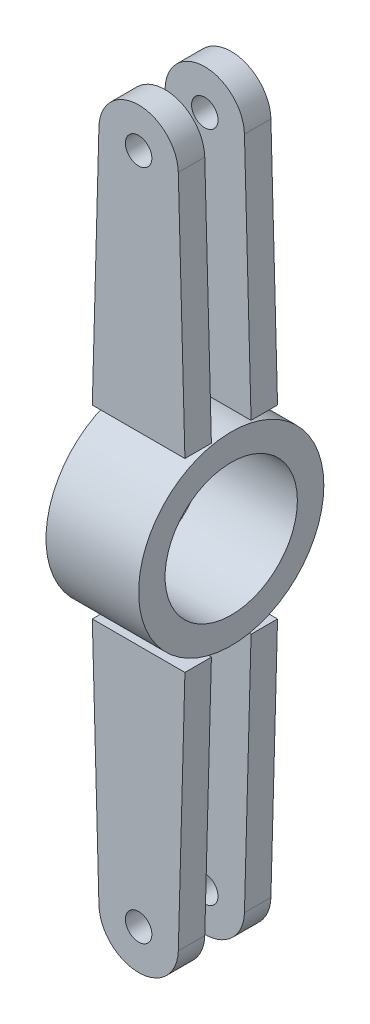
ISO-10303-21;
HEADER;
FILE_DESCRIPTION(('STEP AP214'),'2;1');
FILE_NAME('part.step','',(''),(''),'','','');
FILE_SCHEMA(('AUTOMOTIVE_DESIGN { 1 0 10303 214 1 1 1 1 }'));
ENDSEC;
DATA;
#1=APPLICATION_CONTEXT('core data for automotive mechanical design processes');
#2=APPLICATION_PROTOCOL_DEFINITION('international standard','automotive_design',2000,#1);
#3=PRODUCT_CONTEXT('',#1,'mechanical');
#4=PRODUCT('Part','Part','',(#3));
#5=PRODUCT_RELATED_PRODUCT_CATEGORY('part','',(#4));
#6=PRODUCT_DEFINITION_FORMATION('','',#4);
#7=PRODUCT_DEFINITION_CONTEXT('part definition',#1,'design');
#8=PRODUCT_DEFINITION('design','',#6,#7);
#9=PRODUCT_DEFINITION_SHAPE('','',#8);
#10=(LENGTH_UNIT() NAMED_UNIT(*) SI_UNIT(.MILLI.,.METRE.));
#11=(NAMED_UNIT(*) PLANE_ANGLE_UNIT() SI_UNIT($,.RADIAN.));
#12=(NAMED_UNIT(*) SI_UNIT($,.STERADIAN.) SOLID_ANGLE_UNIT());
#13=UNCERTAINTY_MEASURE_WITH_UNIT(LENGTH_MEASURE(1.E-05),#10,'distance_accuracy_value','');
#14=(GEOMETRIC_REPRESENTATION_CONTEXT(3) GLOBAL_UNCERTAINTY_ASSIGNED_CONTEXT((#13)) GLOBAL_UNIT_ASSIGNED_CONTEXT((#10,
#11,#12)) REPRESENTATION_CONTEXT('',''));
#15=CARTESIAN_POINT('',(0.,0.,0.));
#16=DIRECTION('',(0.,0.,1.));
#17=DIRECTION('',(1.,0.,0.));
#18=AXIS2_PLACEMENT_3D('',#15,#16,#17);
#19=CARTESIAN_POINT('',(0.,127.,17.5));
#20=DIRECTION('',(0.,0.,-1.));
#21=DIRECTION('',(-1.,0.,0.));
#22=AXIS2_PLACEMENT_3D('',#19,#20,#21);
#23=PLANE('',#22);
#24=CARTESIAN_POINT('',(0.,127.,17.5));
#25=DIRECTION('',(0.,0.,1.));
#26=DIRECTION('',(-1.,0.,0.));
#27=AXIS2_PLACEMENT_3D('',#24,#25,#26);
#28=CIRCLE('',#27,15.);
#29=CARTESIAN_POINT('',(14.9944892741488,127.406560459757,17.5));
#30=VERTEX_POINT('',#29);
#31=CARTESIAN_POINT('',(-14.9944892741488,127.406560459757,17.5));
#32=VERTEX_POINT('',#31);
#33=EDGE_CURVE('E100',#30,#32,#28,.T.);
#34=ORIENTED_EDGE('',*,*,#33,.T.);
#35=DIRECTION('',(-0.0271040306504374,-0.999632618276585,0.));
#36=VECTOR('',#35,1.);
#37=CARTESIAN_POINT('',(-17.5,35.,17.5));
#38=LINE('',#37,#36);
#39=CARTESIAN_POINT('',(-17.5,35.,17.5));
#40=VERTEX_POINT('',#39);
#41=EDGE_CURVE('E95',#32,#40,#38,.T.);
#42=ORIENTED_EDGE('',*,*,#41,.T.);
#43=DIRECTION('',(1.,0.,0.));
#44=VECTOR('',#43,1.);
#45=CARTESIAN_POINT('',(-17.5,35.,17.5));
#46=LINE('',#45,#44);
#47=CARTESIAN_POINT('',(17.5,35.,17.5));
#48=VERTEX_POINT('',#47);
#49=EDGE_CURVE('E98',#40,#48,#46,.T.);
#50=ORIENTED_EDGE('',*,*,#49,.T.);
#51=DIRECTION('',(-0.0271040306504372,0.999632618276585,0.));
#52=VECTOR('',#51,1.);
#53=CARTESIAN_POINT('',(17.5,35.,17.5));
#54=LINE('',#53,#52);
#55=EDGE_CURVE('E65',#48,#30,#54,.T.);
#56=ORIENTED_EDGE('',*,*,#55,.T.);
#57=EDGE_LOOP('',(#34,#42,#50,#56));
#58=FACE_BOUND('',#57,.T.);
#59=CARTESIAN_POINT('',(0.,127.,17.5));
#60=DIRECTION('',(0.,0.,1.));
#61=DIRECTION('',(-1.,0.,0.));
#62=AXIS2_PLACEMENT_3D('',#59,#60,#61);
#63=CIRCLE('',#62,5.);
#64=CARTESIAN_POINT('',(-4.99999999999999,127.,17.5));
#65=VERTEX_POINT('',#64);
#66=EDGE_CURVE('E115',#65,#65,#63,.T.);
#67=ORIENTED_EDGE('',*,*,#66,.F.);
#68=EDGE_LOOP('',(#67));
#69=FACE_BOUND('',#68,.T.);
#70=ADVANCED_FACE('F48',(#58,#69),#23,.F.);
#71=CARTESIAN_POINT('',(0.,127.,7.5));
#72=DIRECTION('',(0.,0.,-1.));
#73=DIRECTION('',(-1.,0.,0.));
#74=AXIS2_PLACEMENT_3D('',#71,#72,#73);
#75=PLANE('',#74);
#76=CARTESIAN_POINT('',(0.,127.,7.5));
#77=DIRECTION('',(0.,0.,1.));
#78=DIRECTION('',(-1.,0.,0.));
#79=AXIS2_PLACEMENT_3D('',#76,#77,#78);
#80=CIRCLE('',#79,15.);
#81=CARTESIAN_POINT('',(14.9944892741488,127.406560459757,7.5));
#82=VERTEX_POINT('',#81);
#83=CARTESIAN_POINT('',(-14.9944892741488,127.406560459757,7.5));
#84=VERTEX_POINT('',#83);
#85=EDGE_CURVE('E112',#82,#84,#80,.T.);
#86=ORIENTED_EDGE('',*,*,#85,.F.);
#87=DIRECTION('',(-0.0271040306504372,0.999632618276585,0.));
#88=VECTOR('',#87,1.);
#89=CARTESIAN_POINT('',(17.5,35.,7.5));
#90=LINE('',#89,#88);
#91=CARTESIAN_POINT('',(17.5,35.,7.5));
#92=VERTEX_POINT('',#91);
#93=EDGE_CURVE('E88',#92,#82,#90,.T.);
#94=ORIENTED_EDGE('',*,*,#93,.F.);
#95=DIRECTION('',(1.,0.,0.));
#96=VECTOR('',#95,1.);
#97=CARTESIAN_POINT('',(-17.5,35.,7.5));
#98=LINE('',#97,#96);
#99=CARTESIAN_POINT('',(-17.5,35.,7.5));
#100=VERTEX_POINT('',#99);
#101=EDGE_CURVE('E82',#100,#92,#98,.T.);
#102=ORIENTED_EDGE('',*,*,#101,.F.);
#103=DIRECTION('',(-0.0271040306504374,-0.999632618276585,0.));
#104=VECTOR('',#103,1.);
#105=CARTESIAN_POINT('',(-17.5,35.,7.5));
#106=LINE('',#105,#104);
#107=EDGE_CURVE('E104',#84,#100,#106,.T.);
#108=ORIENTED_EDGE('',*,*,#107,.F.);
#109=EDGE_LOOP('',(#86,#94,#102,#108));
#110=FACE_BOUND('',#109,.T.);
#111=CARTESIAN_POINT('',(0.,127.,7.5));
#112=DIRECTION('',(0.,0.,1.));
#113=DIRECTION('',(-1.,0.,0.));
#114=AXIS2_PLACEMENT_3D('',#111,#112,#113);
#115=CIRCLE('',#114,5.);
#116=CARTESIAN_POINT('',(-4.99999999999999,127.,7.5));
#117=VERTEX_POINT('',#116);
#118=EDGE_CURVE('E127',#117,#117,#115,.T.);
#119=ORIENTED_EDGE('',*,*,#118,.T.);
#120=EDGE_LOOP('',(#119));
#121=FACE_BOUND('',#120,.T.);
#122=ADVANCED_FACE('F123',(#110,#121),#75,.T.);
#123=CARTESIAN_POINT('',(0.,127.,17.5));
#124=DIRECTION('',(0.,0.,-1.));
#125=DIRECTION('',(-1.,0.,0.));
#126=AXIS2_PLACEMENT_3D('',#123,#124,#125);
#127=CYLINDRICAL_SURFACE('',#126,15.);
#128=ORIENTED_EDGE('',*,*,#85,.T.);
#129=DIRECTION('',(0.,0.,-1.));
#130=VECTOR('',#129,1.);
#131=CARTESIAN_POINT('',(-14.9944892741488,127.406560459757,17.5));
#132=LINE('',#131,#130);
#133=EDGE_CURVE('E12',#32,#84,#132,.T.);
#134=ORIENTED_EDGE('',*,*,#133,.F.);
#135=ORIENTED_EDGE('',*,*,#33,.F.);
#136=DIRECTION('',(0.,0.,-1.));
#137=VECTOR('',#136,1.);
#138=CARTESIAN_POINT('',(14.9944892741488,127.406560459757,17.5));
#139=LINE('',#138,#137);
#140=EDGE_CURVE('E108',#30,#82,#139,.T.);
#141=ORIENTED_EDGE('',*,*,#140,.T.);
#142=EDGE_LOOP('',(#128,#134,#135,#141));
#143=FACE_BOUND('',#142,.T.);
#144=ADVANCED_FACE('F50',(#143),#127,.T.);
#145=CARTESIAN_POINT('',(-17.5,35.,17.5));
#146=DIRECTION('',(0.999632618276585,-0.0271040306504374,0.));
#147=DIRECTION('',(0.0271040306504374,0.999632618276585,0.));
#148=AXIS2_PLACEMENT_3D('',#145,#146,#147);
#149=PLANE('',#148);
#150=ORIENTED_EDGE('',*,*,#107,.T.);
#151=DIRECTION('',(0.,0.,-1.));
#152=VECTOR('',#151,1.);
#153=CARTESIAN_POINT('',(-17.5,35.,17.5));
#154=LINE('',#153,#152);
#155=EDGE_CURVE('E57',#40,#100,#154,.T.);
#156=ORIENTED_EDGE('',*,*,#155,.F.);
#157=ORIENTED_EDGE('',*,*,#41,.F.);
#158=ORIENTED_EDGE('',*,*,#133,.T.);
#159=EDGE_LOOP('',(#150,#156,#157,#158));
#160=FACE_BOUND('',#159,.T.);
#161=ADVANCED_FACE('F103',(#160),#149,.F.);
#162=CARTESIAN_POINT('',(-17.5,35.,17.5));
#163=DIRECTION('',(0.,1.,0.));
#164=DIRECTION('',(0.,0.,1.));
#165=AXIS2_PLACEMENT_3D('',#162,#163,#164);
#166=PLANE('',#165);
#167=ORIENTED_EDGE('',*,*,#101,.T.);
#168=DIRECTION('',(0.,0.,-1.));
#169=VECTOR('',#168,1.);
#170=CARTESIAN_POINT('',(17.5,35.,17.5));
#171=LINE('',#170,#169);
#172=EDGE_CURVE('E105',#48,#92,#171,.T.);
#173=ORIENTED_EDGE('',*,*,#172,.F.);
#174=ORIENTED_EDGE('',*,*,#49,.F.);
#175=ORIENTED_EDGE('',*,*,#155,.T.);
#176=EDGE_LOOP('',(#167,#173,#174,#175));
#177=FACE_BOUND('',#176,.T.);
#178=ADVANCED_FACE('F106',(#177),#166,.F.);
#179=CARTESIAN_POINT('',(17.5,35.,17.5));
#180=DIRECTION('',(-0.999632618276585,-0.0271040306504372,0.));
#181=DIRECTION('',(0.0271040306504372,-0.999632618276585,0.));
#182=AXIS2_PLACEMENT_3D('',#179,#180,#181);
#183=PLANE('',#182);
#184=ORIENTED_EDGE('',*,*,#93,.T.);
#185=ORIENTED_EDGE('',*,*,#140,.F.);
#186=ORIENTED_EDGE('',*,*,#55,.F.);
#187=ORIENTED_EDGE('',*,*,#172,.T.);
#188=EDGE_LOOP('',(#184,#185,#186,#187));
#189=FACE_BOUND('',#188,.T.);
#190=ADVANCED_FACE('F120',(#189),#183,.F.);
#191=CARTESIAN_POINT('',(0.,127.,17.5));
#192=DIRECTION('',(0.,0.,-1.));
#193=DIRECTION('',(-1.,0.,0.));
#194=AXIS2_PLACEMENT_3D('',#191,#192,#193);
#195=CYLINDRICAL_SURFACE('',#194,5.);
#196=ORIENTED_EDGE('',*,*,#66,.T.);
#197=EDGE_LOOP('',(#196));
#198=FACE_BOUND('',#197,.T.);
#199=ORIENTED_EDGE('',*,*,#118,.F.);
#200=EDGE_LOOP('',(#199));
#201=FACE_BOUND('',#200,.T.);
#202=ADVANCED_FACE('F133',(#198,#201),#195,.F.);
#203=CLOSED_SHELL('',(#70,#122,#144,#161,#178,#190,#202));
#204=MANIFOLD_SOLID_BREP('B2',#203);
#205=CARTESIAN_POINT('',(0.,-127.,17.5));
#206=DIRECTION('',(0.,0.,1.));
#207=DIRECTION('',(1.,0.,0.));
#208=AXIS2_PLACEMENT_3D('',#205,#206,#207);
#209=PLANE('',#208);
#210=CARTESIAN_POINT('',(0.,-127.,17.5));
#211=DIRECTION('',(0.,0.,1.));
#212=DIRECTION('',(1.,0.,0.));
#213=AXIS2_PLACEMENT_3D('',#210,#211,#212);
#214=CIRCLE('',#213,15.);
#215=CARTESIAN_POINT('',(-14.9944892741488,-127.406560459757,17.5));
#216=VERTEX_POINT('',#215);
#217=CARTESIAN_POINT('',(14.9944892741488,-127.406560459757,17.5));
#218=VERTEX_POINT('',#217);
#219=EDGE_CURVE('E255',#216,#218,#214,.T.);
#220=ORIENTED_EDGE('',*,*,#219,.T.);
#221=DIRECTION('',(0.0271040306504372,0.999632618276585,0.));
#222=VECTOR('',#221,1.);
#223=CARTESIAN_POINT('',(17.5,-35.,17.5));
#224=LINE('',#223,#222);
#225=CARTESIAN_POINT('',(17.5,-35.,17.5));
#226=VERTEX_POINT('',#225);
#227=EDGE_CURVE('E250',#218,#226,#224,.T.);
#228=ORIENTED_EDGE('',*,*,#227,.T.);
#229=DIRECTION('',(-1.,0.,0.));
#230=VECTOR('',#229,1.);
#231=CARTESIAN_POINT('',(-17.5,-35.,17.5));
#232=LINE('',#231,#230);
#233=CARTESIAN_POINT('',(-17.5,-35.,17.5));
#234=VERTEX_POINT('',#233);
#235=EDGE_CURVE('E253',#226,#234,#232,.T.);
#236=ORIENTED_EDGE('',*,*,#235,.T.);
#237=DIRECTION('',(0.0271040306504374,-0.999632618276585,0.));
#238=VECTOR('',#237,1.);
#239=CARTESIAN_POINT('',(-17.5,-35.,17.5));
#240=LINE('',#239,#238);
#241=EDGE_CURVE('E220',#234,#216,#240,.T.);
#242=ORIENTED_EDGE('',*,*,#241,.T.);
#243=EDGE_LOOP('',(#220,#228,#236,#242));
#244=FACE_BOUND('',#243,.T.);
#245=CARTESIAN_POINT('',(0.,-127.,17.5));
#246=DIRECTION('',(0.,0.,1.));
#247=DIRECTION('',(1.,0.,0.));
#248=AXIS2_PLACEMENT_3D('',#245,#246,#247);
#249=CIRCLE('',#248,5.);
#250=CARTESIAN_POINT('',(5.00000000000002,-127.,17.5));
#251=VERTEX_POINT('',#250);
#252=EDGE_CURVE('E270',#251,#251,#249,.T.);
#253=ORIENTED_EDGE('',*,*,#252,.F.);
#254=EDGE_LOOP('',(#253));
#255=FACE_BOUND('',#254,.T.);
#256=ADVANCED_FACE('F203',(#244,#255),#209,.T.);
#257=CARTESIAN_POINT('',(0.,-127.,7.5));
#258=DIRECTION('',(0.,0.,1.));
#259=DIRECTION('',(1.,0.,0.));
#260=AXIS2_PLACEMENT_3D('',#257,#258,#259);
#261=PLANE('',#260);
#262=CARTESIAN_POINT('',(0.,-127.,7.5));
#263=DIRECTION('',(0.,0.,1.));
#264=DIRECTION('',(1.,0.,0.));
#265=AXIS2_PLACEMENT_3D('',#262,#263,#264);
#266=CIRCLE('',#265,15.);
#267=CARTESIAN_POINT('',(-14.9944892741488,-127.406560459757,7.5));
#268=VERTEX_POINT('',#267);
#269=CARTESIAN_POINT('',(14.9944892741488,-127.406560459757,7.5));
#270=VERTEX_POINT('',#269);
#271=EDGE_CURVE('E267',#268,#270,#266,.T.);
#272=ORIENTED_EDGE('',*,*,#271,.F.);
#273=DIRECTION('',(0.0271040306504374,-0.999632618276585,0.));
#274=VECTOR('',#273,1.);
#275=CARTESIAN_POINT('',(-17.5,-35.,7.5));
#276=LINE('',#275,#274);
#277=CARTESIAN_POINT('',(-17.5,-35.,7.5));
#278=VERTEX_POINT('',#277);
#279=EDGE_CURVE('E243',#278,#268,#276,.T.);
#280=ORIENTED_EDGE('',*,*,#279,.F.);
#281=DIRECTION('',(-1.,0.,0.));
#282=VECTOR('',#281,1.);
#283=CARTESIAN_POINT('',(-17.5,-35.,7.5));
#284=LINE('',#283,#282);
#285=CARTESIAN_POINT('',(17.5,-35.,7.5));
#286=VERTEX_POINT('',#285);
#287=EDGE_CURVE('E237',#286,#278,#284,.T.);
#288=ORIENTED_EDGE('',*,*,#287,.F.);
#289=DIRECTION('',(0.0271040306504372,0.999632618276585,0.));
#290=VECTOR('',#289,1.);
#291=CARTESIAN_POINT('',(17.5,-35.,7.5));
#292=LINE('',#291,#290);
#293=EDGE_CURVE('E259',#270,#286,#292,.T.);
#294=ORIENTED_EDGE('',*,*,#293,.F.);
#295=EDGE_LOOP('',(#272,#280,#288,#294));
#296=FACE_BOUND('',#295,.T.);
#297=CARTESIAN_POINT('',(0.,-127.,7.5));
#298=DIRECTION('',(0.,0.,1.));
#299=DIRECTION('',(1.,0.,0.));
#300=AXIS2_PLACEMENT_3D('',#297,#298,#299);
#301=CIRCLE('',#300,5.);
#302=CARTESIAN_POINT('',(5.00000000000002,-127.,7.5));
#303=VERTEX_POINT('',#302);
#304=EDGE_CURVE('E282',#303,#303,#301,.T.);
#305=ORIENTED_EDGE('',*,*,#304,.T.);
#306=EDGE_LOOP('',(#305));
#307=FACE_BOUND('',#306,.T.);
#308=ADVANCED_FACE('F278',(#296,#307),#261,.F.);
#309=CARTESIAN_POINT('',(0.,-127.,17.5));
#310=DIRECTION('',(0.,0.,-1.));
#311=DIRECTION('',(-1.,0.,0.));
#312=AXIS2_PLACEMENT_3D('',#309,#310,#311);
#313=CYLINDRICAL_SURFACE('',#312,15.);
#314=ORIENTED_EDGE('',*,*,#271,.T.);
#315=DIRECTION('',(0.,0.,-1.));
#316=VECTOR('',#315,1.);
#317=CARTESIAN_POINT('',(14.9944892741488,-127.406560459757,17.5));
#318=LINE('',#317,#316);
#319=EDGE_CURVE('E46',#218,#270,#318,.T.);
#320=ORIENTED_EDGE('',*,*,#319,.F.);
#321=ORIENTED_EDGE('',*,*,#219,.F.);
#322=DIRECTION('',(0.,0.,-1.));
#323=VECTOR('',#322,1.);
#324=CARTESIAN_POINT('',(-14.9944892741488,-127.406560459757,17.5));
#325=LINE('',#324,#323);
#326=EDGE_CURVE('E263',#216,#268,#325,.T.);
#327=ORIENTED_EDGE('',*,*,#326,.T.);
#328=EDGE_LOOP('',(#314,#320,#321,#327));
#329=FACE_BOUND('',#328,.T.);
#330=ADVANCED_FACE('F205',(#329),#313,.T.);
#331=CARTESIAN_POINT('',(17.5,-35.,17.5));
#332=DIRECTION('',(-0.999632618276585,0.0271040306504372,0.));
#333=DIRECTION('',(-0.0271040306504372,-0.999632618276585,0.));
#334=AXIS2_PLACEMENT_3D('',#331,#332,#333);
#335=PLANE('',#334);
#336=ORIENTED_EDGE('',*,*,#293,.T.);
#337=DIRECTION('',(0.,0.,-1.));
#338=VECTOR('',#337,1.);
#339=CARTESIAN_POINT('',(17.5,-35.,17.5));
#340=LINE('',#339,#338);
#341=EDGE_CURVE('E212',#226,#286,#340,.T.);
#342=ORIENTED_EDGE('',*,*,#341,.F.);
#343=ORIENTED_EDGE('',*,*,#227,.F.);
#344=ORIENTED_EDGE('',*,*,#319,.T.);
#345=EDGE_LOOP('',(#336,#342,#343,#344));
#346=FACE_BOUND('',#345,.T.);
#347=ADVANCED_FACE('F258',(#346),#335,.F.);
#348=CARTESIAN_POINT('',(-17.5,-35.,17.5));
#349=DIRECTION('',(0.,-1.,0.));
#350=DIRECTION('',(0.,0.,-1.));
#351=AXIS2_PLACEMENT_3D('',#348,#349,#350);
#352=PLANE('',#351);
#353=ORIENTED_EDGE('',*,*,#287,.T.);
#354=DIRECTION('',(0.,0.,-1.));
#355=VECTOR('',#354,1.);
#356=CARTESIAN_POINT('',(-17.5,-35.,17.5));
#357=LINE('',#356,#355);
#358=EDGE_CURVE('E260',#234,#278,#357,.T.);
#359=ORIENTED_EDGE('',*,*,#358,.F.);
#360=ORIENTED_EDGE('',*,*,#235,.F.);
#361=ORIENTED_EDGE('',*,*,#341,.T.);
#362=EDGE_LOOP('',(#353,#359,#360,#361));
#363=FACE_BOUND('',#362,.T.);
#364=ADVANCED_FACE('F261',(#363),#352,.F.);
#365=CARTESIAN_POINT('',(-17.5,-35.,17.5));
#366=DIRECTION('',(0.999632618276585,0.0271040306504374,0.));
#367=DIRECTION('',(-0.0271040306504374,0.999632618276585,0.));
#368=AXIS2_PLACEMENT_3D('',#365,#366,#367);
#369=PLANE('',#368);
#370=ORIENTED_EDGE('',*,*,#279,.T.);
#371=ORIENTED_EDGE('',*,*,#326,.F.);
#372=ORIENTED_EDGE('',*,*,#241,.F.);
#373=ORIENTED_EDGE('',*,*,#358,.T.);
#374=EDGE_LOOP('',(#370,#371,#372,#373));
#375=FACE_BOUND('',#374,.T.);
#376=ADVANCED_FACE('F275',(#375),#369,.F.);
#377=CARTESIAN_POINT('',(0.,-127.,17.5));
#378=DIRECTION('',(0.,0.,-1.));
#379=DIRECTION('',(-1.,0.,0.));
#380=AXIS2_PLACEMENT_3D('',#377,#378,#379);
#381=CYLINDRICAL_SURFACE('',#380,5.);
#382=ORIENTED_EDGE('',*,*,#252,.T.);
#383=EDGE_LOOP('',(#382));
#384=FACE_BOUND('',#383,.T.);
#385=ORIENTED_EDGE('',*,*,#304,.F.);
#386=EDGE_LOOP('',(#385));
#387=FACE_BOUND('',#386,.T.);
#388=ADVANCED_FACE('F288',(#384,#387),#381,.F.);
#389=CLOSED_SHELL('',(#256,#308,#330,#347,#364,#376,#388));
#390=MANIFOLD_SOLID_BREP('B6',#389);
#391=CARTESIAN_POINT('',(0.,127.,-17.5));
#392=DIRECTION('',(0.,0.,1.));
#393=DIRECTION('',(1.,0.,0.));
#394=AXIS2_PLACEMENT_3D('',#391,#392,#393);
#395=CYLINDRICAL_SURFACE('',#394,15.);
#396=CARTESIAN_POINT('',(0.,127.,-7.5));
#397=DIRECTION('',(0.,0.,1.));
#398=DIRECTION('',(-1.,0.,0.));
#399=AXIS2_PLACEMENT_3D('',#396,#397,#398);
#400=CIRCLE('',#399,15.);
#401=CARTESIAN_POINT('',(14.9944892741488,127.406560459757,-7.5));
#402=VERTEX_POINT('',#401);
#403=CARTESIAN_POINT('',(-14.9944892741488,127.406560459757,-7.5));
#404=VERTEX_POINT('',#403);
#405=EDGE_CURVE('E423',#402,#404,#400,.T.);
#406=ORIENTED_EDGE('',*,*,#405,.F.);
#407=DIRECTION('',(0.,0.,1.));
#408=VECTOR('',#407,1.);
#409=CARTESIAN_POINT('',(14.9944892741488,127.406560459757,-17.5));
#410=LINE('',#409,#408);
#411=CARTESIAN_POINT('',(14.9944892741488,127.406560459757,-17.5));
#412=VERTEX_POINT('',#411);
#413=EDGE_CURVE('E201',#412,#402,#410,.T.);
#414=ORIENTED_EDGE('',*,*,#413,.F.);
#415=CARTESIAN_POINT('',(0.,127.,-17.5));
#416=DIRECTION('',(0.,0.,1.));
#417=DIRECTION('',(-1.,0.,0.));
#418=AXIS2_PLACEMENT_3D('',#415,#416,#417);
#419=CIRCLE('',#418,15.);
#420=CARTESIAN_POINT('',(-14.9944892741488,127.406560459757,-17.5));
#421=VERTEX_POINT('',#420);
#422=EDGE_CURVE('E416',#412,#421,#419,.T.);
#423=ORIENTED_EDGE('',*,*,#422,.T.);
#424=DIRECTION('',(0.,0.,1.));
#425=VECTOR('',#424,1.);
#426=CARTESIAN_POINT('',(-14.9944892741488,127.406560459757,-17.5));
#427=LINE('',#426,#425);
#428=EDGE_CURVE('E361',#421,#404,#427,.T.);
#429=ORIENTED_EDGE('',*,*,#428,.T.);
#430=EDGE_LOOP('',(#406,#414,#423,#429));
#431=FACE_BOUND('',#430,.T.);
#432=ADVANCED_FACE('F358',(#431),#395,.T.);
#433=CARTESIAN_POINT('',(17.5,35.,-17.5));
#434=DIRECTION('',(0.999632618276585,0.0271040306504372,0.));
#435=DIRECTION('',(-0.0271040306504372,0.999632618276585,0.));
#436=AXIS2_PLACEMENT_3D('',#433,#434,#435);
#437=PLANE('',#436);
#438=DIRECTION('',(-0.0271040306504372,0.999632618276585,0.));
#439=VECTOR('',#438,1.);
#440=CARTESIAN_POINT('',(17.5,35.,-7.5));
#441=LINE('',#440,#439);
#442=CARTESIAN_POINT('',(17.5,35.,-7.5));
#443=VERTEX_POINT('',#442);
#444=EDGE_CURVE('E418',#443,#402,#441,.T.);
#445=ORIENTED_EDGE('',*,*,#444,.F.);
#446=DIRECTION('',(0.,0.,1.));
#447=VECTOR('',#446,1.);
#448=CARTESIAN_POINT('',(17.5,35.,-17.5));
#449=LINE('',#448,#447);
#450=CARTESIAN_POINT('',(17.5,35.,-17.5));
#451=VERTEX_POINT('',#450);
#452=EDGE_CURVE('E367',#451,#443,#449,.T.);
#453=ORIENTED_EDGE('',*,*,#452,.F.);
#454=DIRECTION('',(-0.0271040306504372,0.999632618276585,0.));
#455=VECTOR('',#454,1.);
#456=CARTESIAN_POINT('',(17.5,35.,-17.5));
#457=LINE('',#456,#455);
#458=EDGE_CURVE('E413',#451,#412,#457,.T.);
#459=ORIENTED_EDGE('',*,*,#458,.T.);
#460=ORIENTED_EDGE('',*,*,#413,.T.);
#461=EDGE_LOOP('',(#445,#453,#459,#460));
#462=FACE_BOUND('',#461,.T.);
#463=ADVANCED_FACE('F434',(#462),#437,.T.);
#464=CARTESIAN_POINT('',(-17.5,35.,-17.5));
#465=DIRECTION('',(0.,-1.,0.));
#466=DIRECTION('',(0.,0.,-1.));
#467=AXIS2_PLACEMENT_3D('',#464,#465,#466);
#468=PLANE('',#467);
#469=DIRECTION('',(1.,0.,0.));
#470=VECTOR('',#469,1.);
#471=CARTESIAN_POINT('',(-17.5,35.,-7.5));
#472=LINE('',#471,#470);
#473=CARTESIAN_POINT('',(-17.5,35.,-7.5));
#474=VERTEX_POINT('',#473);
#475=EDGE_CURVE('E408',#474,#443,#472,.T.);
#476=ORIENTED_EDGE('',*,*,#475,.F.);
#477=DIRECTION('',(0.,0.,1.));
#478=VECTOR('',#477,1.);
#479=CARTESIAN_POINT('',(-17.5,35.,-17.5));
#480=LINE('',#479,#478);
#481=CARTESIAN_POINT('',(-17.5,35.,-17.5));
#482=VERTEX_POINT('',#481);
#483=EDGE_CURVE('E403',#482,#474,#480,.T.);
#484=ORIENTED_EDGE('',*,*,#483,.F.);
#485=DIRECTION('',(1.,0.,0.));
#486=VECTOR('',#485,1.);
#487=CARTESIAN_POINT('',(-17.5,35.,-17.5));
#488=LINE('',#487,#486);
#489=EDGE_CURVE('E406',#482,#451,#488,.T.);
#490=ORIENTED_EDGE('',*,*,#489,.T.);
#491=ORIENTED_EDGE('',*,*,#452,.T.);
#492=EDGE_LOOP('',(#476,#484,#490,#491));
#493=FACE_BOUND('',#492,.T.);
#494=ADVANCED_FACE('F405',(#493),#468,.T.);
#495=CARTESIAN_POINT('',(-17.5,35.,-17.5));
#496=DIRECTION('',(-0.999632618276585,0.0271040306504374,0.));
#497=DIRECTION('',(-0.0271040306504374,-0.999632618276585,0.));
#498=AXIS2_PLACEMENT_3D('',#495,#496,#497);
#499=PLANE('',#498);
#500=DIRECTION('',(-0.0271040306504374,-0.999632618276585,0.));
#501=VECTOR('',#500,1.);
#502=CARTESIAN_POINT('',(-17.5,35.,-7.5));
#503=LINE('',#502,#501);
#504=EDGE_CURVE('E426',#404,#474,#503,.T.);
#505=ORIENTED_EDGE('',*,*,#504,.F.);
#506=ORIENTED_EDGE('',*,*,#428,.F.);
#507=DIRECTION('',(-0.0271040306504374,-0.999632618276585,0.));
#508=VECTOR('',#507,1.);
#509=CARTESIAN_POINT('',(-17.5,35.,-17.5));
#510=LINE('',#509,#508);
#511=EDGE_CURVE('E412',#421,#482,#510,.T.);
#512=ORIENTED_EDGE('',*,*,#511,.T.);
#513=ORIENTED_EDGE('',*,*,#483,.T.);
#514=EDGE_LOOP('',(#505,#506,#512,#513));
#515=FACE_BOUND('',#514,.T.);
#516=ADVANCED_FACE('F415',(#515),#499,.T.);
#517=CARTESIAN_POINT('',(0.,127.,-17.5));
#518=DIRECTION('',(0.,0.,-1.));
#519=DIRECTION('',(-1.,0.,0.));
#520=AXIS2_PLACEMENT_3D('',#517,#518,#519);
#521=PLANE('',#520);
#522=CARTESIAN_POINT('',(0.,127.,-17.5));
#523=DIRECTION('',(0.,0.,1.));
#524=DIRECTION('',(-1.,0.,0.));
#525=AXIS2_PLACEMENT_3D('',#522,#523,#524);
#526=CIRCLE('',#525,5.);
#527=CARTESIAN_POINT('',(-4.99999999999999,127.,-17.5));
#528=VERTEX_POINT('',#527);
#529=EDGE_CURVE('E427',#528,#528,#526,.T.);
#530=ORIENTED_EDGE('',*,*,#529,.T.);
#531=EDGE_LOOP('',(#530));
#532=FACE_BOUND('',#531,.T.);
#533=ORIENTED_EDGE('',*,*,#422,.F.);
#534=ORIENTED_EDGE('',*,*,#458,.F.);
#535=ORIENTED_EDGE('',*,*,#489,.F.);
#536=ORIENTED_EDGE('',*,*,#511,.F.);
#537=EDGE_LOOP('',(#533,#534,#535,#536));
#538=FACE_BOUND('',#537,.T.);
#539=ADVANCED_FACE('F411',(#532,#538),#521,.T.);
#540=CARTESIAN_POINT('',(0.,127.,-7.5));
#541=DIRECTION('',(0.,0.,-1.));
#542=DIRECTION('',(-1.,0.,0.));
#543=AXIS2_PLACEMENT_3D('',#540,#541,#542);
#544=PLANE('',#543);
#545=CARTESIAN_POINT('',(0.,127.,-7.5));
#546=DIRECTION('',(0.,0.,1.));
#547=DIRECTION('',(-1.,0.,0.));
#548=AXIS2_PLACEMENT_3D('',#545,#546,#547);
#549=CIRCLE('',#548,5.);
#550=CARTESIAN_POINT('',(-4.99999999999999,127.,-7.5));
#551=VERTEX_POINT('',#550);
#552=EDGE_CURVE('E464',#551,#551,#549,.T.);
#553=ORIENTED_EDGE('',*,*,#552,.F.);
#554=EDGE_LOOP('',(#553));
#555=FACE_BOUND('',#554,.T.);
#556=ORIENTED_EDGE('',*,*,#405,.T.);
#557=ORIENTED_EDGE('',*,*,#504,.T.);
#558=ORIENTED_EDGE('',*,*,#475,.T.);
#559=ORIENTED_EDGE('',*,*,#444,.T.);
#560=EDGE_LOOP('',(#556,#557,#558,#559));
#561=FACE_BOUND('',#560,.T.);
#562=ADVANCED_FACE('F433',(#555,#561),#544,.F.);
#563=CARTESIAN_POINT('',(0.,127.,-17.5));
#564=DIRECTION('',(0.,0.,1.));
#565=DIRECTION('',(1.,0.,0.));
#566=AXIS2_PLACEMENT_3D('',#563,#564,#565);
#567=CYLINDRICAL_SURFACE('',#566,5.);
#568=ORIENTED_EDGE('',*,*,#529,.F.);
#569=EDGE_LOOP('',(#568));
#570=FACE_BOUND('',#569,.T.);
#571=ORIENTED_EDGE('',*,*,#552,.T.);
#572=EDGE_LOOP('',(#571));
#573=FACE_BOUND('',#572,.T.);
#574=ADVANCED_FACE('F452',(#570,#573),#567,.F.);
#575=CLOSED_SHELL('',(#432,#463,#494,#516,#539,#562,#574));
#576=MANIFOLD_SOLID_BREP('B40',#575);
#577=CARTESIAN_POINT('',(0.,-127.,-17.5));
#578=DIRECTION('',(0.,0.,1.));
#579=DIRECTION('',(1.,0.,0.));
#580=AXIS2_PLACEMENT_3D('',#577,#578,#579);
#581=CYLINDRICAL_SURFACE('',#580,15.);
#582=CARTESIAN_POINT('',(0.,-127.,-7.5));
#583=DIRECTION('',(0.,0.,1.));
#584=DIRECTION('',(1.,0.,0.));
#585=AXIS2_PLACEMENT_3D('',#582,#583,#584);
#586=CIRCLE('',#585,15.);
#587=CARTESIAN_POINT('',(-14.9944892741488,-127.406560459757,-7.5));
#588=VERTEX_POINT('',#587);
#589=CARTESIAN_POINT('',(14.9944892741488,-127.406560459757,-7.5));
#590=VERTEX_POINT('',#589);
#591=EDGE_CURVE('E575',#588,#590,#586,.T.);
#592=ORIENTED_EDGE('',*,*,#591,.F.);
#593=DIRECTION('',(0.,0.,1.));
#594=VECTOR('',#593,1.);
#595=CARTESIAN_POINT('',(-14.9944892741488,-127.406560459757,-17.5));
#596=LINE('',#595,#594);
#597=CARTESIAN_POINT('',(-14.9944892741488,-127.406560459757,-17.5));
#598=VERTEX_POINT('',#597);
#599=EDGE_CURVE('E356',#598,#588,#596,.T.);
#600=ORIENTED_EDGE('',*,*,#599,.F.);
#601=CARTESIAN_POINT('',(0.,-127.,-17.5));
#602=DIRECTION('',(0.,0.,1.));
#603=DIRECTION('',(1.,0.,0.));
#604=AXIS2_PLACEMENT_3D('',#601,#602,#603);
#605=CIRCLE('',#604,15.);
#606=CARTESIAN_POINT('',(14.9944892741488,-127.406560459757,-17.5));
#607=VERTEX_POINT('',#606);
#608=EDGE_CURVE('E568',#598,#607,#605,.T.);
#609=ORIENTED_EDGE('',*,*,#608,.T.);
#610=DIRECTION('',(0.,0.,1.));
#611=VECTOR('',#610,1.);
#612=CARTESIAN_POINT('',(14.9944892741488,-127.406560459757,-17.5));
#613=LINE('',#612,#611);
#614=EDGE_CURVE('E513',#607,#590,#613,.T.);
#615=ORIENTED_EDGE('',*,*,#614,.T.);
#616=EDGE_LOOP('',(#592,#600,#609,#615));
#617=FACE_BOUND('',#616,.T.);
#618=ADVANCED_FACE('F510',(#617),#581,.T.);
#619=CARTESIAN_POINT('',(-17.5,-35.,-17.5));
#620=DIRECTION('',(-0.999632618276585,-0.0271040306504374,0.));
#621=DIRECTION('',(0.0271040306504374,-0.999632618276585,0.));
#622=AXIS2_PLACEMENT_3D('',#619,#620,#621);
#623=PLANE('',#622);
#624=DIRECTION('',(0.0271040306504374,-0.999632618276585,0.));
#625=VECTOR('',#624,1.);
#626=CARTESIAN_POINT('',(-17.5,-35.,-7.5));
#627=LINE('',#626,#625);
#628=CARTESIAN_POINT('',(-17.5,-35.,-7.5));
#629=VERTEX_POINT('',#628);
#630=EDGE_CURVE('E570',#629,#588,#627,.T.);
#631=ORIENTED_EDGE('',*,*,#630,.F.);
#632=DIRECTION('',(0.,0.,1.));
#633=VECTOR('',#632,1.);
#634=CARTESIAN_POINT('',(-17.5,-35.,-17.5));
#635=LINE('',#634,#633);
#636=CARTESIAN_POINT('',(-17.5,-35.,-17.5));
#637=VERTEX_POINT('',#636);
#638=EDGE_CURVE('E519',#637,#629,#635,.T.);
#639=ORIENTED_EDGE('',*,*,#638,.F.);
#640=DIRECTION('',(0.0271040306504374,-0.999632618276585,0.));
#641=VECTOR('',#640,1.);
#642=CARTESIAN_POINT('',(-17.5,-35.,-17.5));
#643=LINE('',#642,#641);
#644=EDGE_CURVE('E565',#637,#598,#643,.T.);
#645=ORIENTED_EDGE('',*,*,#644,.T.);
#646=ORIENTED_EDGE('',*,*,#599,.T.);
#647=EDGE_LOOP('',(#631,#639,#645,#646));
#648=FACE_BOUND('',#647,.T.);
#649=ADVANCED_FACE('F586',(#648),#623,.T.);
#650=CARTESIAN_POINT('',(-17.5,-35.,-17.5));
#651=DIRECTION('',(0.,1.,0.));
#652=DIRECTION('',(0.,0.,1.));
#653=AXIS2_PLACEMENT_3D('',#650,#651,#652);
#654=PLANE('',#653);
#655=DIRECTION('',(-1.,0.,0.));
#656=VECTOR('',#655,1.);
#657=CARTESIAN_POINT('',(-17.5,-35.,-7.5));
#658=LINE('',#657,#656);
#659=CARTESIAN_POINT('',(17.5,-35.,-7.5));
#660=VERTEX_POINT('',#659);
#661=EDGE_CURVE('E560',#660,#629,#658,.T.);
#662=ORIENTED_EDGE('',*,*,#661,.F.);
#663=DIRECTION('',(0.,0.,1.));
#664=VECTOR('',#663,1.);
#665=CARTESIAN_POINT('',(17.5,-35.,-17.5));
#666=LINE('',#665,#664);
#667=CARTESIAN_POINT('',(17.5,-35.,-17.5));
#668=VERTEX_POINT('',#667);
#669=EDGE_CURVE('E555',#668,#660,#666,.T.);
#670=ORIENTED_EDGE('',*,*,#669,.F.);
#671=DIRECTION('',(-1.,0.,0.));
#672=VECTOR('',#671,1.);
#673=CARTESIAN_POINT('',(-17.5,-35.,-17.5));
#674=LINE('',#673,#672);
#675=EDGE_CURVE('E558',#668,#637,#674,.T.);
#676=ORIENTED_EDGE('',*,*,#675,.T.);
#677=ORIENTED_EDGE('',*,*,#638,.T.);
#678=EDGE_LOOP('',(#662,#670,#676,#677));
#679=FACE_BOUND('',#678,.T.);
#680=ADVANCED_FACE('F557',(#679),#654,.T.);
#681=CARTESIAN_POINT('',(17.5,-35.,-17.5));
#682=DIRECTION('',(0.999632618276585,-0.0271040306504372,0.));
#683=DIRECTION('',(0.0271040306504372,0.999632618276585,0.));
#684=AXIS2_PLACEMENT_3D('',#681,#682,#683);
#685=PLANE('',#684);
#686=DIRECTION('',(0.0271040306504372,0.999632618276585,0.));
#687=VECTOR('',#686,1.);
#688=CARTESIAN_POINT('',(17.5,-35.,-7.5));
#689=LINE('',#688,#687);
#690=EDGE_CURVE('E578',#590,#660,#689,.T.);
#691=ORIENTED_EDGE('',*,*,#690,.F.);
#692=ORIENTED_EDGE('',*,*,#614,.F.);
#693=DIRECTION('',(0.0271040306504372,0.999632618276585,0.));
#694=VECTOR('',#693,1.);
#695=CARTESIAN_POINT('',(17.5,-35.,-17.5));
#696=LINE('',#695,#694);
#697=EDGE_CURVE('E564',#607,#668,#696,.T.);
#698=ORIENTED_EDGE('',*,*,#697,.T.);
#699=ORIENTED_EDGE('',*,*,#669,.T.);
#700=EDGE_LOOP('',(#691,#692,#698,#699));
#701=FACE_BOUND('',#700,.T.);
#702=ADVANCED_FACE('F567',(#701),#685,.T.);
#703=CARTESIAN_POINT('',(0.,-127.,-17.5));
#704=DIRECTION('',(0.,0.,1.));
#705=DIRECTION('',(1.,0.,0.));
#706=AXIS2_PLACEMENT_3D('',#703,#704,#705);
#707=PLANE('',#706);
#708=CARTESIAN_POINT('',(0.,-127.,-17.5));
#709=DIRECTION('',(0.,0.,1.));
#710=DIRECTION('',(1.,0.,0.));
#711=AXIS2_PLACEMENT_3D('',#708,#709,#710);
#712=CIRCLE('',#711,5.);
#713=CARTESIAN_POINT('',(5.00000000000002,-127.,-17.5));
#714=VERTEX_POINT('',#713);
#715=EDGE_CURVE('E579',#714,#714,#712,.T.);
#716=ORIENTED_EDGE('',*,*,#715,.T.);
#717=EDGE_LOOP('',(#716));
#718=FACE_BOUND('',#717,.T.);
#719=ORIENTED_EDGE('',*,*,#608,.F.);
#720=ORIENTED_EDGE('',*,*,#644,.F.);
#721=ORIENTED_EDGE('',*,*,#675,.F.);
#722=ORIENTED_EDGE('',*,*,#697,.F.);
#723=EDGE_LOOP('',(#719,#720,#721,#722));
#724=FACE_BOUND('',#723,.T.);
#725=ADVANCED_FACE('F563',(#718,#724),#707,.F.);
#726=CARTESIAN_POINT('',(0.,-127.,-7.5));
#727=DIRECTION('',(0.,0.,1.));
#728=DIRECTION('',(1.,0.,0.));
#729=AXIS2_PLACEMENT_3D('',#726,#727,#728);
#730=PLANE('',#729);
#731=CARTESIAN_POINT('',(0.,-127.,-7.5));
#732=DIRECTION('',(0.,0.,1.));
#733=DIRECTION('',(1.,0.,0.));
#734=AXIS2_PLACEMENT_3D('',#731,#732,#733);
#735=CIRCLE('',#734,5.);
#736=CARTESIAN_POINT('',(5.00000000000002,-127.,-7.5));
#737=VERTEX_POINT('',#736);
#738=EDGE_CURVE('E616',#737,#737,#735,.T.);
#739=ORIENTED_EDGE('',*,*,#738,.F.);
#740=EDGE_LOOP('',(#739));
#741=FACE_BOUND('',#740,.T.);
#742=ORIENTED_EDGE('',*,*,#591,.T.);
#743=ORIENTED_EDGE('',*,*,#690,.T.);
#744=ORIENTED_EDGE('',*,*,#661,.T.);
#745=ORIENTED_EDGE('',*,*,#630,.T.);
#746=EDGE_LOOP('',(#742,#743,#744,#745));
#747=FACE_BOUND('',#746,.T.);
#748=ADVANCED_FACE('F585',(#741,#747),#730,.T.);
#749=CARTESIAN_POINT('',(0.,-127.,-17.5));
#750=DIRECTION('',(0.,0.,1.));
#751=DIRECTION('',(1.,0.,0.));
#752=AXIS2_PLACEMENT_3D('',#749,#750,#751);
#753=CYLINDRICAL_SURFACE('',#752,5.);
#754=ORIENTED_EDGE('',*,*,#715,.F.);
#755=EDGE_LOOP('',(#754));
#756=FACE_BOUND('',#755,.T.);
#757=ORIENTED_EDGE('',*,*,#738,.T.);
#758=EDGE_LOOP('',(#757));
#759=FACE_BOUND('',#758,.T.);
#760=ADVANCED_FACE('F604',(#756,#759),#753,.F.);
#761=CLOSED_SHELL('',(#618,#649,#680,#702,#725,#748,#760));
#762=MANIFOLD_SOLID_BREP('B195',#761);
#763=CARTESIAN_POINT('',(17.5,0.,0.));
#764=DIRECTION('',(1.,0.,0.));
#765=DIRECTION('',(0.,0.,-1.));
#766=AXIS2_PLACEMENT_3D('',#763,#764,#765);
#767=PLANE('',#766);
#768=CARTESIAN_POINT('',(17.5,0.,0.));
#769=DIRECTION('',(1.,0.,0.));
#770=DIRECTION('',(0.,0.,-1.));
#771=AXIS2_PLACEMENT_3D('',#768,#769,#770);
#772=CIRCLE('',#771,35.);
#773=CARTESIAN_POINT('',(17.5,0.,-35.));
#774=VERTEX_POINT('',#773);
#775=EDGE_CURVE('E509',#774,#774,#772,.T.);
#776=ORIENTED_EDGE('',*,*,#775,.T.);
#777=EDGE_LOOP('',(#776));
#778=FACE_BOUND('',#777,.T.);
#779=CARTESIAN_POINT('',(17.5,0.,0.));
#780=DIRECTION('',(1.,0.,0.));
#781=DIRECTION('',(0.,0.,-1.));
#782=AXIS2_PLACEMENT_3D('',#779,#780,#781);
#783=CIRCLE('',#782,25.);
#784=CARTESIAN_POINT('',(17.5,0.,-25.));
#785=VERTEX_POINT('',#784);
#786=EDGE_CURVE('E666',#785,#785,#783,.T.);
#787=ORIENTED_EDGE('',*,*,#786,.F.);
#788=EDGE_LOOP('',(#787));
#789=FACE_BOUND('',#788,.T.);
#790=ADVANCED_FACE('F655',(#778,#789),#767,.T.);
#791=CARTESIAN_POINT('',(-17.5,0.,0.));
#792=DIRECTION('',(1.,0.,0.));
#793=DIRECTION('',(0.,0.,-1.));
#794=AXIS2_PLACEMENT_3D('',#791,#792,#793);
#795=PLANE('',#794);
#796=CARTESIAN_POINT('',(-17.5,0.,0.));
#797=DIRECTION('',(1.,0.,0.));
#798=DIRECTION('',(0.,0.,-1.));
#799=AXIS2_PLACEMENT_3D('',#796,#797,#798);
#800=CIRCLE('',#799,35.);
#801=CARTESIAN_POINT('',(-17.5,0.,-35.));
#802=VERTEX_POINT('',#801);
#803=EDGE_CURVE('E659',#802,#802,#800,.T.);
#804=ORIENTED_EDGE('',*,*,#803,.F.);
#805=EDGE_LOOP('',(#804));
#806=FACE_BOUND('',#805,.T.);
#807=CARTESIAN_POINT('',(-17.5,0.,0.));
#808=DIRECTION('',(1.,0.,0.));
#809=DIRECTION('',(0.,0.,-1.));
#810=AXIS2_PLACEMENT_3D('',#807,#808,#809);
#811=CIRCLE('',#810,25.);
#812=CARTESIAN_POINT('',(-17.5,0.,-25.));
#813=VERTEX_POINT('',#812);
#814=EDGE_CURVE('E668',#813,#813,#811,.T.);
#815=ORIENTED_EDGE('',*,*,#814,.T.);
#816=EDGE_LOOP('',(#815));
#817=FACE_BOUND('',#816,.T.);
#818=ADVANCED_FACE('F678',(#806,#817),#795,.F.);
#819=CARTESIAN_POINT('',(17.5,0.,0.));
#820=DIRECTION('',(-1.,0.,0.));
#821=DIRECTION('',(0.,0.,1.));
#822=AXIS2_PLACEMENT_3D('',#819,#820,#821);
#823=CYLINDRICAL_SURFACE('',#822,35.);
#824=ORIENTED_EDGE('',*,*,#775,.F.);
#825=EDGE_LOOP('',(#824));
#826=FACE_BOUND('',#825,.T.);
#827=ORIENTED_EDGE('',*,*,#803,.T.);
#828=EDGE_LOOP('',(#827));
#829=FACE_BOUND('',#828,.T.);
#830=ADVANCED_FACE('F657',(#826,#829),#823,.T.);
#831=CARTESIAN_POINT('',(17.5,0.,0.));
#832=DIRECTION('',(-1.,0.,0.));
#833=DIRECTION('',(0.,0.,1.));
#834=AXIS2_PLACEMENT_3D('',#831,#832,#833);
#835=CYLINDRICAL_SURFACE('',#834,25.);
#836=ORIENTED_EDGE('',*,*,#786,.T.);
#837=EDGE_LOOP('',(#836));
#838=FACE_BOUND('',#837,.T.);
#839=ORIENTED_EDGE('',*,*,#814,.F.);
#840=EDGE_LOOP('',(#839));
#841=FACE_BOUND('',#840,.T.);
#842=ADVANCED_FACE('F674',(#838,#841),#835,.F.);
#843=CLOSED_SHELL('',(#790,#818,#830,#842));
#844=MANIFOLD_SOLID_BREP('B350',#843);
#845=ADVANCED_BREP_SHAPE_REPRESENTATION('',(#18,#204,#390,#576,#762,#844),#14);
#846=SHAPE_DEFINITION_REPRESENTATION(#9,#845);
ENDSEC;
END-ISO-10303-21;
